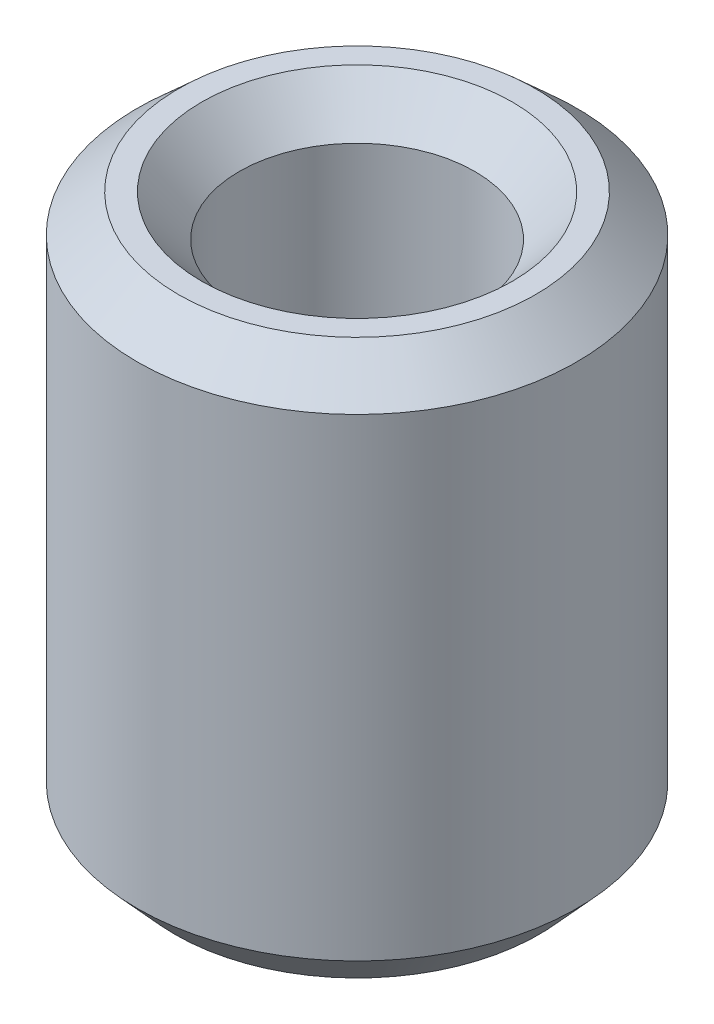
ISO-10303-21;
HEADER;
FILE_DESCRIPTION(('STEP AP214'),'2;1');
FILE_NAME('part.step','',(''),(''),'','','');
FILE_SCHEMA(('AUTOMOTIVE_DESIGN { 1 0 10303 214 1 1 1 1 }'));
ENDSEC;
DATA;
#1=APPLICATION_CONTEXT('core data for automotive mechanical design processes');
#2=APPLICATION_PROTOCOL_DEFINITION('international standard','automotive_design',2000,#1);
#3=PRODUCT_CONTEXT('',#1,'mechanical');
#4=PRODUCT('Part','Part','',(#3));
#5=PRODUCT_RELATED_PRODUCT_CATEGORY('part','',(#4));
#6=PRODUCT_DEFINITION_FORMATION('','',#4);
#7=PRODUCT_DEFINITION_CONTEXT('part definition',#1,'design');
#8=PRODUCT_DEFINITION('design','',#6,#7);
#9=PRODUCT_DEFINITION_SHAPE('','',#8);
#10=(LENGTH_UNIT() NAMED_UNIT(*) SI_UNIT(.MILLI.,.METRE.));
#11=(NAMED_UNIT(*) PLANE_ANGLE_UNIT() SI_UNIT($,.RADIAN.));
#12=(NAMED_UNIT(*) SI_UNIT($,.STERADIAN.) SOLID_ANGLE_UNIT());
#13=UNCERTAINTY_MEASURE_WITH_UNIT(LENGTH_MEASURE(1.E-05),#10,'distance_accuracy_value','');
#14=(GEOMETRIC_REPRESENTATION_CONTEXT(3) GLOBAL_UNCERTAINTY_ASSIGNED_CONTEXT((#13)) GLOBAL_UNIT_ASSIGNED_CONTEXT((#10,
#11,#12)) REPRESENTATION_CONTEXT('',''));
#15=CARTESIAN_POINT('',(0.,0.,0.));
#16=DIRECTION('',(0.,0.,1.));
#17=DIRECTION('',(1.,0.,0.));
#18=AXIS2_PLACEMENT_3D('',#15,#16,#17);
#19=CARTESIAN_POINT('',(0.,37.6918815763987,0.));
#20=DIRECTION('',(0.,-1.,0.));
#21=DIRECTION('',(0.,0.,-1.));
#22=AXIS2_PLACEMENT_3D('',#19,#20,#21);
#23=CYLINDRICAL_SURFACE('',#22,15.);
#24=CARTESIAN_POINT('',(0.,2.81911868949085,0.));
#25=DIRECTION('',(0.,1.,0.));
#26=DIRECTION('',(0.,0.,1.));
#27=AXIS2_PLACEMENT_3D('',#24,#25,#26);
#28=CIRCLE('',#27,15.);
#29=CARTESIAN_POINT('',(0.,2.81911868949085,15.));
#30=VERTEX_POINT('',#29);
#31=EDGE_CURVE('E10',#30,#30,#28,.T.);
#32=ORIENTED_EDGE('',*,*,#31,.T.);
#33=EDGE_LOOP('',(#32));
#34=FACE_BOUND('',#33,.T.);
#35=CARTESIAN_POINT('',(0.,35.1249806088453,0.));
#36=DIRECTION('',(0.,1.,0.));
#37=DIRECTION('',(0.,0.,1.));
#38=AXIS2_PLACEMENT_3D('',#35,#36,#37);
#39=CIRCLE('',#38,15.);
#40=CARTESIAN_POINT('',(0.,35.1249806088453,15.));
#41=VERTEX_POINT('',#40);
#42=EDGE_CURVE('E50',#41,#41,#39,.F.);
#43=ORIENTED_EDGE('',*,*,#42,.T.);
#44=EDGE_LOOP('',(#43));
#45=FACE_BOUND('',#44,.T.);
#46=ADVANCED_FACE('F39',(#34,#45),#23,.T.);
#47=CARTESIAN_POINT('',(0.,37.6918815763987,0.));
#48=DIRECTION('',(0.,1.,0.));
#49=DIRECTION('',(0.,0.,1.));
#50=AXIS2_PLACEMENT_3D('',#47,#48,#49);
#51=PLANE('',#50);
#52=CARTESIAN_POINT('',(0.,37.6918815763987,0.));
#53=DIRECTION('',(0.,1.,0.));
#54=DIRECTION('',(0.,0.,1.));
#55=AXIS2_PLACEMENT_3D('',#52,#53,#54);
#56=CIRCLE('',#55,10.6013448996799);
#57=CARTESIAN_POINT('',(0.,37.6918815763987,10.6013448996799));
#58=VERTEX_POINT('',#57);
#59=EDGE_CURVE('E58',#58,#58,#56,.F.);
#60=ORIENTED_EDGE('',*,*,#59,.T.);
#61=EDGE_LOOP('',(#60));
#62=FACE_BOUND('',#61,.T.);
#63=CARTESIAN_POINT('',(0.,37.6918815763987,0.));
#64=DIRECTION('',(0.,1.,0.));
#65=DIRECTION('',(0.,0.,1.));
#66=AXIS2_PLACEMENT_3D('',#63,#64,#65);
#67=CIRCLE('',#66,12.1808813105092);
#68=CARTESIAN_POINT('',(0.,37.6918815763987,12.1808813105092));
#69=VERTEX_POINT('',#68);
#70=EDGE_CURVE('E61',#69,#69,#67,.T.);
#71=ORIENTED_EDGE('',*,*,#70,.T.);
#72=EDGE_LOOP('',(#71));
#73=FACE_BOUND('',#72,.T.);
#74=ADVANCED_FACE('F88',(#62,#73),#51,.T.);
#75=CARTESIAN_POINT('',(0.,0.,0.));
#76=DIRECTION('',(0.,1.,0.));
#77=DIRECTION('',(0.,0.,1.));
#78=AXIS2_PLACEMENT_3D('',#75,#76,#77);
#79=PLANE('',#78);
#80=CARTESIAN_POINT('',(0.,0.,0.));
#81=DIRECTION('',(0.,1.,0.));
#82=DIRECTION('',(0.,0.,1.));
#83=AXIS2_PLACEMENT_3D('',#80,#81,#82);
#84=CIRCLE('',#83,10.8535626216173);
#85=CARTESIAN_POINT('',(0.,0.,10.8535626216173));
#86=VERTEX_POINT('',#85);
#87=EDGE_CURVE('E51',#86,#86,#84,.T.);
#88=ORIENTED_EDGE('',*,*,#87,.T.);
#89=EDGE_LOOP('',(#88));
#90=FACE_BOUND('',#89,.T.);
#91=CARTESIAN_POINT('',(0.,0.,0.));
#92=DIRECTION('',(0.,1.,0.));
#93=DIRECTION('',(0.,0.,1.));
#94=AXIS2_PLACEMENT_3D('',#91,#92,#93);
#95=CIRCLE('',#94,12.4330990324466);
#96=CARTESIAN_POINT('',(0.,0.,12.4330990324466));
#97=VERTEX_POINT('',#96);
#98=EDGE_CURVE('E54',#97,#97,#95,.F.);
#99=ORIENTED_EDGE('',*,*,#98,.T.);
#100=EDGE_LOOP('',(#99));
#101=FACE_BOUND('',#100,.T.);
#102=ADVANCED_FACE('F83',(#90,#101),#79,.F.);
#103=CARTESIAN_POINT('',(0.,37.6918815763987,0.));
#104=DIRECTION('',(0.,-1.,0.));
#105=DIRECTION('',(0.,0.,-1.));
#106=AXIS2_PLACEMENT_3D('',#103,#104,#105);
#107=CYLINDRICAL_SURFACE('',#106,8.03444393212649);
#108=CARTESIAN_POINT('',(0.,34.8727628869079,0.));
#109=DIRECTION('',(0.,1.,0.));
#110=DIRECTION('',(0.,0.,1.));
#111=AXIS2_PLACEMENT_3D('',#108,#109,#110);
#112=CIRCLE('',#111,8.03444393212649);
#113=CARTESIAN_POINT('',(0.,34.8727628869079,8.03444393212649));
#114=VERTEX_POINT('',#113);
#115=EDGE_CURVE('E67',#114,#114,#112,.T.);
#116=ORIENTED_EDGE('',*,*,#115,.T.);
#117=EDGE_LOOP('',(#116));
#118=FACE_BOUND('',#117,.T.);
#119=CARTESIAN_POINT('',(0.,2.56690096755342,0.));
#120=DIRECTION('',(0.,1.,0.));
#121=DIRECTION('',(0.,0.,1.));
#122=AXIS2_PLACEMENT_3D('',#119,#120,#121);
#123=CIRCLE('',#122,8.03444393212649);
#124=CARTESIAN_POINT('',(0.,2.56690096755342,8.03444393212649));
#125=VERTEX_POINT('',#124);
#126=EDGE_CURVE('E69',#125,#125,#123,.F.);
#127=ORIENTED_EDGE('',*,*,#126,.T.);
#128=EDGE_LOOP('',(#127));
#129=FACE_BOUND('',#128,.T.);
#130=ADVANCED_FACE('F71',(#118,#129),#107,.F.);
#131=CARTESIAN_POINT('',(0.,34.8727628869079,0.));
#132=DIRECTION('',(0.,1.,0.));
#133=DIRECTION('',(0.,0.,1.));
#134=AXIS2_PLACEMENT_3D('',#131,#132,#133);
#135=CONICAL_SURFACE('',#134,8.03444393212649,0.738604126443726);
#136=ORIENTED_EDGE('',*,*,#59,.F.);
#137=EDGE_LOOP('',(#136));
#138=FACE_BOUND('',#137,.T.);
#139=ORIENTED_EDGE('',*,*,#115,.F.);
#140=EDGE_LOOP('',(#139));
#141=FACE_BOUND('',#140,.T.);
#142=ADVANCED_FACE('F77',(#138,#141),#135,.F.);
#143=CARTESIAN_POINT('',(0.,0.,0.));
#144=DIRECTION('',(0.,-1.,0.));
#145=DIRECTION('',(0.,0.,-1.));
#146=AXIS2_PLACEMENT_3D('',#143,#144,#145);
#147=CONICAL_SURFACE('',#146,10.8535626216173,0.83219220035117);
#148=ORIENTED_EDGE('',*,*,#126,.F.);
#149=EDGE_LOOP('',(#148));
#150=FACE_BOUND('',#149,.T.);
#151=ORIENTED_EDGE('',*,*,#87,.F.);
#152=EDGE_LOOP('',(#151));
#153=FACE_BOUND('',#152,.T.);
#154=ADVANCED_FACE('F73',(#150,#153),#147,.F.);
#155=CARTESIAN_POINT('',(0.,2.81911868949085,0.));
#156=DIRECTION('',(0.,1.,0.));
#157=DIRECTION('',(0.,0.,1.));
#158=AXIS2_PLACEMENT_3D('',#155,#156,#157);
#159=CONICAL_SURFACE('',#158,15.,0.738604126443728);
#160=ORIENTED_EDGE('',*,*,#98,.F.);
#161=EDGE_LOOP('',(#160));
#162=FACE_BOUND('',#161,.T.);
#163=ORIENTED_EDGE('',*,*,#31,.F.);
#164=EDGE_LOOP('',(#163));
#165=FACE_BOUND('',#164,.T.);
#166=ADVANCED_FACE('F76',(#162,#165),#159,.T.);
#167=CARTESIAN_POINT('',(0.,37.6918815763987,0.));
#168=DIRECTION('',(0.,-1.,0.));
#169=DIRECTION('',(0.,0.,-1.));
#170=AXIS2_PLACEMENT_3D('',#167,#168,#169);
#171=CONICAL_SURFACE('',#170,12.1808813105092,0.832192200351168);
#172=ORIENTED_EDGE('',*,*,#42,.F.);
#173=EDGE_LOOP('',(#172));
#174=FACE_BOUND('',#173,.T.);
#175=ORIENTED_EDGE('',*,*,#70,.F.);
#176=EDGE_LOOP('',(#175));
#177=FACE_BOUND('',#176,.T.);
#178=ADVANCED_FACE('F45',(#174,#177),#171,.T.);
#179=CLOSED_SHELL('',(#46,#74,#102,#130,#142,#154,#166,#178));
#180=MANIFOLD_SOLID_BREP('B2',#179);
#181=ADVANCED_BREP_SHAPE_REPRESENTATION('',(#18,#180),#14);
#182=SHAPE_DEFINITION_REPRESENTATION(#9,#181);
ENDSEC;
END-ISO-10303-21;
